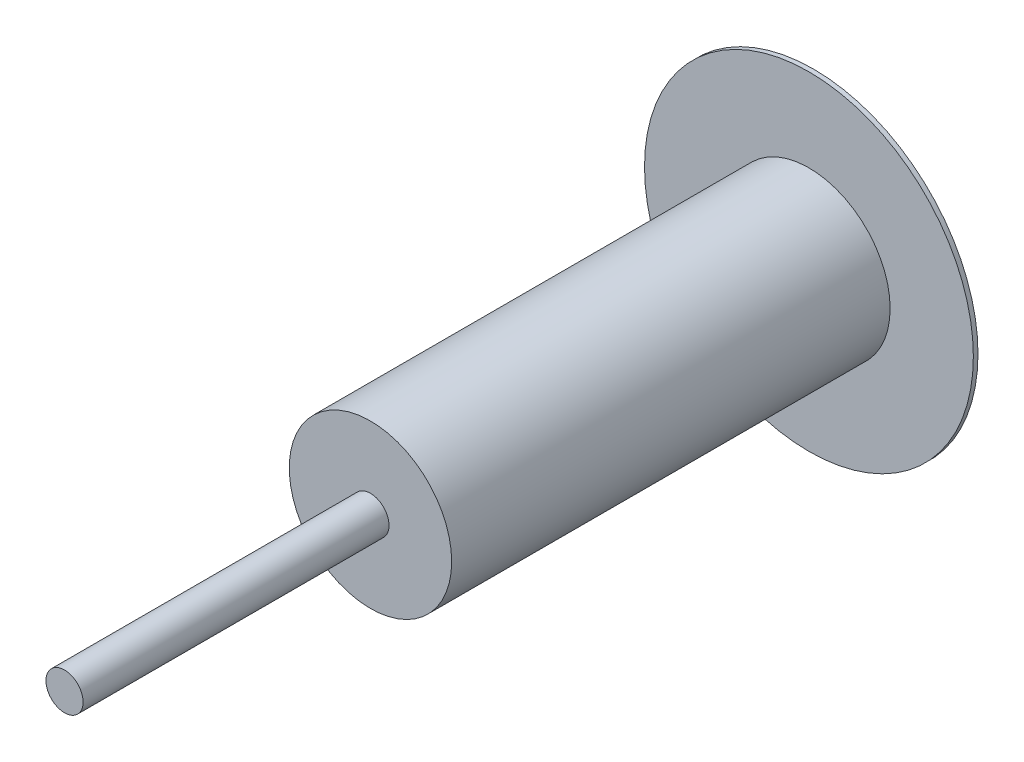
ISO-10303-21;
HEADER;
FILE_DESCRIPTION(('STEP AP214'),'2;1');
FILE_NAME('part.step','',(''),(''),'','','');
FILE_SCHEMA(('AUTOMOTIVE_DESIGN { 1 0 10303 214 1 1 1 1 }'));
ENDSEC;
DATA;
#1=APPLICATION_CONTEXT('core data for automotive mechanical design processes');
#2=APPLICATION_PROTOCOL_DEFINITION('international standard','automotive_design',2000,#1);
#3=PRODUCT_CONTEXT('',#1,'mechanical');
#4=PRODUCT('Part','Part','',(#3));
#5=PRODUCT_RELATED_PRODUCT_CATEGORY('part','',(#4));
#6=PRODUCT_DEFINITION_FORMATION('','',#4);
#7=PRODUCT_DEFINITION_CONTEXT('part definition',#1,'design');
#8=PRODUCT_DEFINITION('design','',#6,#7);
#9=PRODUCT_DEFINITION_SHAPE('','',#8);
#10=(LENGTH_UNIT() NAMED_UNIT(*) SI_UNIT(.MILLI.,.METRE.));
#11=(NAMED_UNIT(*) PLANE_ANGLE_UNIT() SI_UNIT($,.RADIAN.));
#12=(NAMED_UNIT(*) SI_UNIT($,.STERADIAN.) SOLID_ANGLE_UNIT());
#13=UNCERTAINTY_MEASURE_WITH_UNIT(LENGTH_MEASURE(1.E-05),#10,'distance_accuracy_value','');
#14=(GEOMETRIC_REPRESENTATION_CONTEXT(3) GLOBAL_UNCERTAINTY_ASSIGNED_CONTEXT((#13)) GLOBAL_UNIT_ASSIGNED_CONTEXT((#10,
#11,#12)) REPRESENTATION_CONTEXT('',''));
#15=CARTESIAN_POINT('',(0.,0.,0.));
#16=DIRECTION('',(0.,0.,1.));
#17=DIRECTION('',(1.,0.,0.));
#18=AXIS2_PLACEMENT_3D('',#15,#16,#17);
#19=CARTESIAN_POINT('',(0.,0.,-1350.9));
#20=DIRECTION('',(0.,0.,-1.));
#21=DIRECTION('',(-1.,0.,0.));
#22=AXIS2_PLACEMENT_3D('',#19,#20,#21);
#23=CYLINDRICAL_SURFACE('',#22,450.);
#24=CARTESIAN_POINT('',(0.,0.,-1350.9));
#25=DIRECTION('',(0.,0.,1.));
#26=DIRECTION('',(1.,0.,0.));
#27=AXIS2_PLACEMENT_3D('',#24,#25,#26);
#28=CIRCLE('',#27,450.);
#29=CARTESIAN_POINT('',(450.,0.,-1350.9));
#30=VERTEX_POINT('',#29);
#31=EDGE_CURVE('E45',#30,#30,#28,.T.);
#32=ORIENTED_EDGE('',*,*,#31,.F.);
#33=EDGE_LOOP('',(#32));
#34=FACE_BOUND('',#33,.T.);
#35=CARTESIAN_POINT('',(0.,0.,-1363.6));
#36=DIRECTION('',(0.,0.,1.));
#37=DIRECTION('',(1.,0.,0.));
#38=AXIS2_PLACEMENT_3D('',#35,#36,#37);
#39=CIRCLE('',#38,450.);
#40=CARTESIAN_POINT('',(450.,0.,-1363.6));
#41=VERTEX_POINT('',#40);
#42=EDGE_CURVE('E49',#41,#41,#39,.T.);
#43=ORIENTED_EDGE('',*,*,#42,.T.);
#44=EDGE_LOOP('',(#43));
#45=FACE_BOUND('',#44,.T.);
#46=ADVANCED_FACE('F37',(#34,#45),#23,.T.);
#47=CARTESIAN_POINT('',(0.,0.,-1350.9));
#48=DIRECTION('',(0.,0.,1.));
#49=DIRECTION('',(1.,0.,0.));
#50=AXIS2_PLACEMENT_3D('',#47,#48,#49);
#51=PLANE('',#50);
#52=CARTESIAN_POINT('',(0.,0.,-1350.9));
#53=DIRECTION('',(0.,0.,1.));
#54=DIRECTION('',(1.,0.,0.));
#55=AXIS2_PLACEMENT_3D('',#52,#53,#54);
#56=CIRCLE('',#55,222.25);
#57=CARTESIAN_POINT('',(222.25,0.,-1350.9));
#58=VERTEX_POINT('',#57);
#59=EDGE_CURVE('E54',#58,#58,#56,.T.);
#60=ORIENTED_EDGE('',*,*,#59,.F.);
#61=EDGE_LOOP('',(#60));
#62=FACE_BOUND('',#61,.T.);
#63=ORIENTED_EDGE('',*,*,#31,.T.);
#64=EDGE_LOOP('',(#63));
#65=FACE_BOUND('',#64,.T.);
#66=ADVANCED_FACE('F79',(#62,#65),#51,.T.);
#67=CARTESIAN_POINT('',(0.,0.,-1363.6));
#68=DIRECTION('',(0.,0.,1.));
#69=DIRECTION('',(1.,0.,0.));
#70=AXIS2_PLACEMENT_3D('',#67,#68,#69);
#71=PLANE('',#70);
#72=ORIENTED_EDGE('',*,*,#42,.F.);
#73=EDGE_LOOP('',(#72));
#74=FACE_BOUND('',#73,.T.);
#75=ADVANCED_FACE('F75',(#74),#71,.F.);
#76=CARTESIAN_POINT('',(0.,0.,-150.9));
#77=DIRECTION('',(0.,0.,-1.));
#78=DIRECTION('',(-1.,0.,0.));
#79=AXIS2_PLACEMENT_3D('',#76,#77,#78);
#80=CYLINDRICAL_SURFACE('',#79,222.25);
#81=CARTESIAN_POINT('',(0.,0.,-150.9));
#82=DIRECTION('',(0.,0.,1.));
#83=DIRECTION('',(1.,0.,0.));
#84=AXIS2_PLACEMENT_3D('',#81,#82,#83);
#85=CIRCLE('',#84,222.25);
#86=CARTESIAN_POINT('',(222.25,0.,-150.9));
#87=VERTEX_POINT('',#86);
#88=EDGE_CURVE('E57',#87,#87,#85,.T.);
#89=ORIENTED_EDGE('',*,*,#88,.F.);
#90=EDGE_LOOP('',(#89));
#91=FACE_BOUND('',#90,.T.);
#92=ORIENTED_EDGE('',*,*,#59,.T.);
#93=EDGE_LOOP('',(#92));
#94=FACE_BOUND('',#93,.T.);
#95=ADVANCED_FACE('F69',(#91,#94),#80,.T.);
#96=CARTESIAN_POINT('',(0.,0.,-150.9));
#97=DIRECTION('',(0.,0.,1.));
#98=DIRECTION('',(1.,0.,0.));
#99=AXIS2_PLACEMENT_3D('',#96,#97,#98);
#100=PLANE('',#99);
#101=CARTESIAN_POINT('',(0.,0.,-150.9));
#102=DIRECTION('',(0.,0.,1.));
#103=DIRECTION('',(1.,0.,0.));
#104=AXIS2_PLACEMENT_3D('',#101,#102,#103);
#105=CIRCLE('',#104,50.8);
#106=CARTESIAN_POINT('',(50.8,0.,-150.9));
#107=VERTEX_POINT('',#106);
#108=EDGE_CURVE('E41',#107,#107,#105,.T.);
#109=ORIENTED_EDGE('',*,*,#108,.F.);
#110=EDGE_LOOP('',(#109));
#111=FACE_BOUND('',#110,.T.);
#112=ORIENTED_EDGE('',*,*,#88,.T.);
#113=EDGE_LOOP('',(#112));
#114=FACE_BOUND('',#113,.T.);
#115=ADVANCED_FACE('F66',(#111,#114),#100,.T.);
#116=CARTESIAN_POINT('',(0.,0.,686.4));
#117=DIRECTION('',(0.,0.,1.));
#118=DIRECTION('',(1.,0.,0.));
#119=AXIS2_PLACEMENT_3D('',#116,#117,#118);
#120=PLANE('',#119);
#121=CARTESIAN_POINT('',(0.,0.,686.4));
#122=DIRECTION('',(0.,0.,1.));
#123=DIRECTION('',(1.,0.,0.));
#124=AXIS2_PLACEMENT_3D('',#121,#122,#123);
#125=CIRCLE('',#124,50.8);
#126=CARTESIAN_POINT('',(50.8,0.,686.4));
#127=VERTEX_POINT('',#126);
#128=EDGE_CURVE('E10',#127,#127,#125,.T.);
#129=ORIENTED_EDGE('',*,*,#128,.T.);
#130=EDGE_LOOP('',(#129));
#131=FACE_BOUND('',#130,.T.);
#132=ADVANCED_FACE('F68',(#131),#120,.T.);
#133=CARTESIAN_POINT('',(0.,0.,686.4));
#134=DIRECTION('',(0.,0.,-1.));
#135=DIRECTION('',(-1.,0.,0.));
#136=AXIS2_PLACEMENT_3D('',#133,#134,#135);
#137=CYLINDRICAL_SURFACE('',#136,50.8);
#138=ORIENTED_EDGE('',*,*,#108,.T.);
#139=EDGE_LOOP('',(#138));
#140=FACE_BOUND('',#139,.T.);
#141=ORIENTED_EDGE('',*,*,#128,.F.);
#142=EDGE_LOOP('',(#141));
#143=FACE_BOUND('',#142,.T.);
#144=ADVANCED_FACE('F39',(#140,#143),#137,.T.);
#145=CLOSED_SHELL('',(#46,#66,#75,#95,#115,#132,#144));
#146=MANIFOLD_SOLID_BREP('B2',#145);
#147=ADVANCED_BREP_SHAPE_REPRESENTATION('',(#18,#146),#14);
#148=SHAPE_DEFINITION_REPRESENTATION(#9,#147);
ENDSEC;
END-ISO-10303-21;
